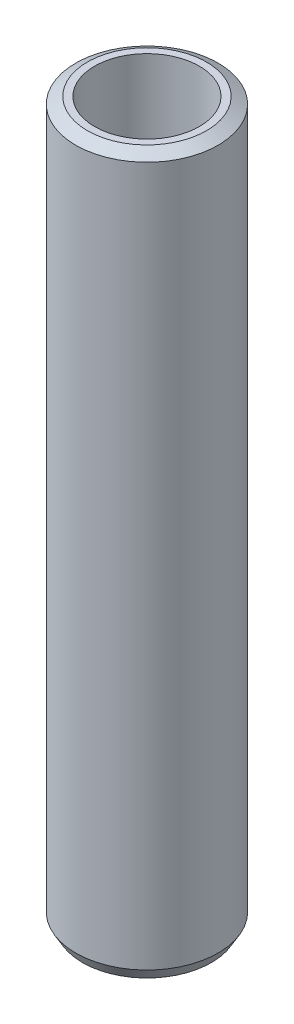
ISO-10303-21;
HEADER;
FILE_DESCRIPTION(('STEP AP214'),'2;1');
FILE_NAME('part.step','',(''),(''),'','','');
FILE_SCHEMA(('AUTOMOTIVE_DESIGN { 1 0 10303 214 1 1 1 1 }'));
ENDSEC;
DATA;
#1=APPLICATION_CONTEXT('core data for automotive mechanical design processes');
#2=APPLICATION_PROTOCOL_DEFINITION('international standard','automotive_design',2000,#1);
#3=PRODUCT_CONTEXT('',#1,'mechanical');
#4=PRODUCT('Part','Part','',(#3));
#5=PRODUCT_RELATED_PRODUCT_CATEGORY('part','',(#4));
#6=PRODUCT_DEFINITION_FORMATION('','',#4);
#7=PRODUCT_DEFINITION_CONTEXT('part definition',#1,'design');
#8=PRODUCT_DEFINITION('design','',#6,#7);
#9=PRODUCT_DEFINITION_SHAPE('','',#8);
#10=(LENGTH_UNIT() NAMED_UNIT(*) SI_UNIT(.MILLI.,.METRE.));
#11=(NAMED_UNIT(*) PLANE_ANGLE_UNIT() SI_UNIT($,.RADIAN.));
#12=(NAMED_UNIT(*) SI_UNIT($,.STERADIAN.) SOLID_ANGLE_UNIT());
#13=UNCERTAINTY_MEASURE_WITH_UNIT(LENGTH_MEASURE(1.E-05),#10,'distance_accuracy_value','');
#14=(GEOMETRIC_REPRESENTATION_CONTEXT(3) GLOBAL_UNCERTAINTY_ASSIGNED_CONTEXT((#13)) GLOBAL_UNIT_ASSIGNED_CONTEXT((#10,
#11,#12)) REPRESENTATION_CONTEXT('',''));
#15=CARTESIAN_POINT('',(0.,0.,0.));
#16=DIRECTION('',(0.,0.,1.));
#17=DIRECTION('',(1.,0.,0.));
#18=AXIS2_PLACEMENT_3D('',#15,#16,#17);
#19=CARTESIAN_POINT('',(0.,529.359882504728,0.));
#20=DIRECTION('',(0.,-1.,0.));
#21=DIRECTION('',(0.,0.,-1.));
#22=AXIS2_PLACEMENT_3D('',#19,#20,#21);
#23=CYLINDRICAL_SURFACE('',#22,52.5);
#24=CARTESIAN_POINT('',(0.,524.394247016187,0.));
#25=DIRECTION('',(0.,1.,0.));
#26=DIRECTION('',(0.,0.,1.));
#27=AXIS2_PLACEMENT_3D('',#24,#25,#26);
#28=CIRCLE('',#27,52.5);
#29=CARTESIAN_POINT('',(0.,524.394247016187,52.5));
#30=VERTEX_POINT('',#29);
#31=EDGE_CURVE('E50',#30,#30,#28,.F.);
#32=ORIENTED_EDGE('',*,*,#31,.T.);
#33=EDGE_LOOP('',(#32));
#34=FACE_BOUND('',#33,.T.);
#35=CARTESIAN_POINT('',(0.,8.60073295802099,0.));
#36=DIRECTION('',(0.,1.,0.));
#37=DIRECTION('',(0.,0.,1.));
#38=AXIS2_PLACEMENT_3D('',#35,#36,#37);
#39=CIRCLE('',#38,52.5);
#40=CARTESIAN_POINT('',(0.,8.60073295802099,52.5));
#41=VERTEX_POINT('',#40);
#42=EDGE_CURVE('E51',#41,#41,#39,.T.);
#43=ORIENTED_EDGE('',*,*,#42,.T.);
#44=EDGE_LOOP('',(#43));
#45=FACE_BOUND('',#44,.T.);
#46=ADVANCED_FACE('F39',(#34,#45),#23,.T.);
#47=CARTESIAN_POINT('',(0.,529.359882504728,0.));
#48=DIRECTION('',(0.,1.,0.));
#49=DIRECTION('',(0.,0.,1.));
#50=AXIS2_PLACEMENT_3D('',#47,#48,#49);
#51=PLANE('',#50);
#52=CARTESIAN_POINT('',(0.,529.359882504728,0.));
#53=DIRECTION('',(0.,1.,0.));
#54=DIRECTION('',(0.,0.,1.));
#55=AXIS2_PLACEMENT_3D('',#52,#53,#54);
#56=CIRCLE('',#55,43.8992670419791);
#57=CARTESIAN_POINT('',(0.,529.359882504728,43.8992670419791));
#58=VERTEX_POINT('',#57);
#59=EDGE_CURVE('E54',#58,#58,#56,.T.);
#60=ORIENTED_EDGE('',*,*,#59,.T.);
#61=EDGE_LOOP('',(#60));
#62=FACE_BOUND('',#61,.T.);
#63=CARTESIAN_POINT('',(0.,529.359882504728,0.));
#64=DIRECTION('',(0.,1.,0.));
#65=DIRECTION('',(0.,0.,1.));
#66=AXIS2_PLACEMENT_3D('',#63,#64,#65);
#67=CIRCLE('',#66,38.6205657339645);
#68=CARTESIAN_POINT('',(0.,529.359882504728,38.6205657339645));
#69=VERTEX_POINT('',#68);
#70=EDGE_CURVE('E58',#69,#69,#67,.T.);
#71=ORIENTED_EDGE('',*,*,#70,.F.);
#72=EDGE_LOOP('',(#71));
#73=FACE_BOUND('',#72,.T.);
#74=ADVANCED_FACE('F69',(#62,#73),#51,.T.);
#75=CARTESIAN_POINT('',(0.,0.,0.));
#76=DIRECTION('',(0.,1.,0.));
#77=DIRECTION('',(0.,0.,1.));
#78=AXIS2_PLACEMENT_3D('',#75,#76,#77);
#79=PLANE('',#78);
#80=CARTESIAN_POINT('',(0.,0.,0.));
#81=DIRECTION('',(0.,1.,0.));
#82=DIRECTION('',(0.,0.,1.));
#83=AXIS2_PLACEMENT_3D('',#80,#81,#82);
#84=CIRCLE('',#83,47.5343645114585);
#85=CARTESIAN_POINT('',(0.,0.,47.5343645114585));
#86=VERTEX_POINT('',#85);
#87=EDGE_CURVE('E10',#86,#86,#84,.F.);
#88=ORIENTED_EDGE('',*,*,#87,.T.);
#89=EDGE_LOOP('',(#88));
#90=FACE_BOUND('',#89,.T.);
#91=CARTESIAN_POINT('',(0.,0.,0.));
#92=DIRECTION('',(0.,1.,0.));
#93=DIRECTION('',(0.,0.,1.));
#94=AXIS2_PLACEMENT_3D('',#91,#92,#93);
#95=CIRCLE('',#94,38.6205657339645);
#96=CARTESIAN_POINT('',(0.,0.,38.6205657339645));
#97=VERTEX_POINT('',#96);
#98=EDGE_CURVE('E63',#97,#97,#95,.T.);
#99=ORIENTED_EDGE('',*,*,#98,.T.);
#100=EDGE_LOOP('',(#99));
#101=FACE_BOUND('',#100,.T.);
#102=ADVANCED_FACE('F75',(#90,#101),#79,.F.);
#103=CARTESIAN_POINT('',(0.,529.359882504728,0.));
#104=DIRECTION('',(0.,-1.,0.));
#105=DIRECTION('',(0.,0.,-1.));
#106=AXIS2_PLACEMENT_3D('',#103,#104,#105);
#107=CYLINDRICAL_SURFACE('',#106,38.6205657339645);
#108=ORIENTED_EDGE('',*,*,#70,.T.);
#109=EDGE_LOOP('',(#108));
#110=FACE_BOUND('',#109,.T.);
#111=ORIENTED_EDGE('',*,*,#98,.F.);
#112=EDGE_LOOP('',(#111));
#113=FACE_BOUND('',#112,.T.);
#114=ADVANCED_FACE('F70',(#110,#113),#107,.F.);
#115=CARTESIAN_POINT('',(0.,529.359882504728,0.));
#116=DIRECTION('',(0.,-1.,0.));
#117=DIRECTION('',(0.,0.,-1.));
#118=AXIS2_PLACEMENT_3D('',#115,#116,#117);
#119=CONICAL_SURFACE('',#118,43.8992670419791,1.04719755119658);
#120=ORIENTED_EDGE('',*,*,#31,.F.);
#121=EDGE_LOOP('',(#120));
#122=FACE_BOUND('',#121,.T.);
#123=ORIENTED_EDGE('',*,*,#59,.F.);
#124=EDGE_LOOP('',(#123));
#125=FACE_BOUND('',#124,.T.);
#126=ADVANCED_FACE('F81',(#122,#125),#119,.T.);
#127=CARTESIAN_POINT('',(0.,8.60073295802099,0.));
#128=DIRECTION('',(0.,1.,0.));
#129=DIRECTION('',(0.,0.,1.));
#130=AXIS2_PLACEMENT_3D('',#127,#128,#129);
#131=CONICAL_SURFACE('',#130,52.5,0.523598775598302);
#132=ORIENTED_EDGE('',*,*,#87,.F.);
#133=EDGE_LOOP('',(#132));
#134=FACE_BOUND('',#133,.T.);
#135=ORIENTED_EDGE('',*,*,#42,.F.);
#136=EDGE_LOOP('',(#135));
#137=FACE_BOUND('',#136,.T.);
#138=ADVANCED_FACE('F45',(#134,#137),#131,.T.);
#139=CLOSED_SHELL('',(#46,#74,#102,#114,#126,#138));
#140=MANIFOLD_SOLID_BREP('B2',#139);
#141=ADVANCED_BREP_SHAPE_REPRESENTATION('',(#18,#140),#14);
#142=SHAPE_DEFINITION_REPRESENTATION(#9,#141);
ENDSEC;
END-ISO-10303-21;
